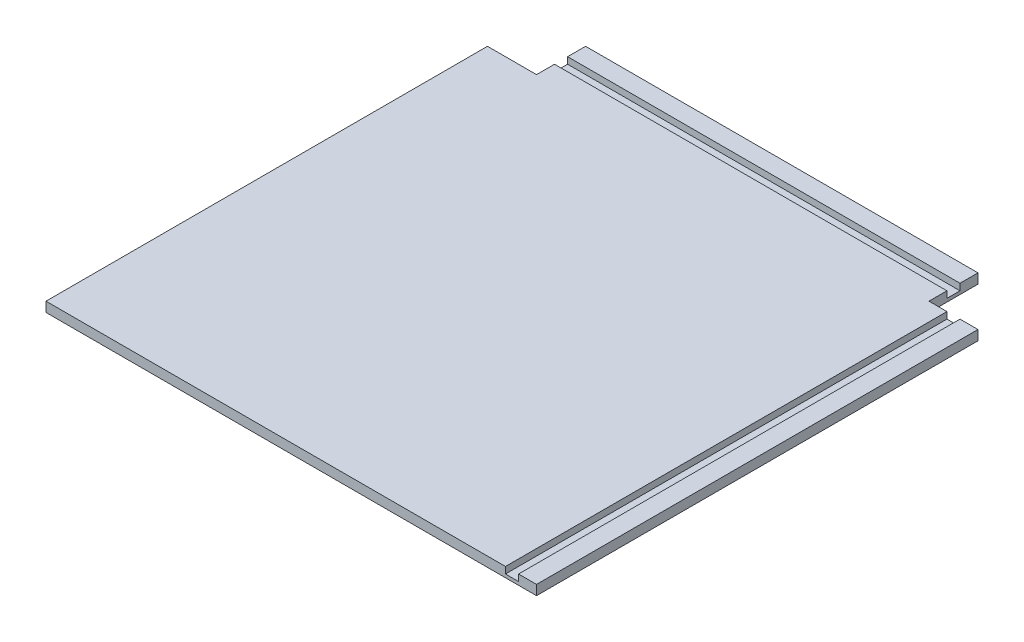
ISO-10303-21;
HEADER;
FILE_DESCRIPTION(('STEP AP214'),'2;1');
FILE_NAME('part.step','',(''),(''),'','','');
FILE_SCHEMA(('AUTOMOTIVE_DESIGN { 1 0 10303 214 1 1 1 1 }'));
ENDSEC;
DATA;
#1=APPLICATION_CONTEXT('core data for automotive mechanical design processes');
#2=APPLICATION_PROTOCOL_DEFINITION('international standard','automotive_design',2000,#1);
#3=PRODUCT_CONTEXT('',#1,'mechanical');
#4=PRODUCT('Part','Part','',(#3));
#5=PRODUCT_RELATED_PRODUCT_CATEGORY('part','',(#4));
#6=PRODUCT_DEFINITION_FORMATION('','',#4);
#7=PRODUCT_DEFINITION_CONTEXT('part definition',#1,'design');
#8=PRODUCT_DEFINITION('design','',#6,#7);
#9=PRODUCT_DEFINITION_SHAPE('','',#8);
#10=(LENGTH_UNIT() NAMED_UNIT(*) SI_UNIT(.MILLI.,.METRE.));
#11=(NAMED_UNIT(*) PLANE_ANGLE_UNIT() SI_UNIT($,.RADIAN.));
#12=(NAMED_UNIT(*) SI_UNIT($,.STERADIAN.) SOLID_ANGLE_UNIT());
#13=UNCERTAINTY_MEASURE_WITH_UNIT(LENGTH_MEASURE(1.E-05),#10,'distance_accuracy_value','');
#14=(GEOMETRIC_REPRESENTATION_CONTEXT(3) GLOBAL_UNCERTAINTY_ASSIGNED_CONTEXT((#13)) GLOBAL_UNIT_ASSIGNED_CONTEXT((#10,
#11,#12)) REPRESENTATION_CONTEXT('',''));
#15=CARTESIAN_POINT('',(0.,0.,0.));
#16=DIRECTION('',(0.,0.,1.));
#17=DIRECTION('',(1.,0.,0.));
#18=AXIS2_PLACEMENT_3D('',#15,#16,#17);
#19=CARTESIAN_POINT('',(0.,15.,0.));
#20=DIRECTION('',(0.,1.,0.));
#21=DIRECTION('',(0.,0.,1.));
#22=AXIS2_PLACEMENT_3D('',#19,#20,#21);
#23=PLANE('',#22);
#24=DIRECTION('',(1.,0.,0.));
#25=VECTOR('',#24,1.);
#26=CARTESIAN_POINT('',(-375.,15.,-327.5));
#27=LINE('',#26,#25);
#28=CARTESIAN_POINT('',(-300.,15.,-327.5));
#29=VERTEX_POINT('',#28);
#30=CARTESIAN_POINT('',(300.,15.,-327.5));
#31=VERTEX_POINT('',#30);
#32=EDGE_CURVE('E306',#29,#31,#27,.T.);
#33=ORIENTED_EDGE('',*,*,#32,.F.);
#34=DIRECTION('',(0.,0.,1.));
#35=VECTOR('',#34,1.);
#36=CARTESIAN_POINT('',(-300.,15.,0.));
#37=LINE('',#36,#35);
#38=CARTESIAN_POINT('',(-300.,15.,-300.));
#39=VERTEX_POINT('',#38);
#40=EDGE_CURVE('E172',#29,#39,#37,.T.);
#41=ORIENTED_EDGE('',*,*,#40,.T.);
#42=DIRECTION('',(1.,0.,0.));
#43=VECTOR('',#42,1.);
#44=CARTESIAN_POINT('',(0.,15.,-300.));
#45=LINE('',#44,#43);
#46=CARTESIAN_POINT('',(-375.,15.,-300.));
#47=VERTEX_POINT('',#46);
#48=EDGE_CURVE('E182',#47,#39,#45,.T.);
#49=ORIENTED_EDGE('',*,*,#48,.F.);
#50=DIRECTION('',(0.,0.,-1.));
#51=VECTOR('',#50,1.);
#52=CARTESIAN_POINT('',(-375.,15.,0.));
#53=LINE('',#52,#51);
#54=CARTESIAN_POINT('',(-375.,15.,375.));
#55=VERTEX_POINT('',#54);
#56=EDGE_CURVE('E189',#55,#47,#53,.T.);
#57=ORIENTED_EDGE('',*,*,#56,.F.);
#58=DIRECTION('',(1.,0.,0.));
#59=VECTOR('',#58,1.);
#60=CARTESIAN_POINT('',(0.,15.,375.));
#61=LINE('',#60,#59);
#62=CARTESIAN_POINT('',(327.5,15.,375.));
#63=VERTEX_POINT('',#62);
#64=EDGE_CURVE('E193',#55,#63,#61,.T.);
#65=ORIENTED_EDGE('',*,*,#64,.T.);
#66=DIRECTION('',(0.,0.,1.));
#67=VECTOR('',#66,1.);
#68=CARTESIAN_POINT('',(327.5,15.,-300.));
#69=LINE('',#68,#67);
#70=CARTESIAN_POINT('',(327.5,15.,-300.));
#71=VERTEX_POINT('',#70);
#72=EDGE_CURVE('E273',#71,#63,#69,.T.);
#73=ORIENTED_EDGE('',*,*,#72,.F.);
#74=DIRECTION('',(-1.,0.,0.));
#75=VECTOR('',#74,1.);
#76=CARTESIAN_POINT('',(0.,15.,-300.));
#77=LINE('',#76,#75);
#78=CARTESIAN_POINT('',(300.,15.,-300.));
#79=VERTEX_POINT('',#78);
#80=EDGE_CURVE('E198',#71,#79,#77,.T.);
#81=ORIENTED_EDGE('',*,*,#80,.T.);
#82=DIRECTION('',(0.,0.,1.));
#83=VECTOR('',#82,1.);
#84=CARTESIAN_POINT('',(300.,15.,0.));
#85=LINE('',#84,#83);
#86=EDGE_CURVE('E225',#31,#79,#85,.T.);
#87=ORIENTED_EDGE('',*,*,#86,.F.);
#88=EDGE_LOOP('',(#33,#41,#49,#57,#65,#73,#81,#87));
#89=FACE_BOUND('',#88,.T.);
#90=ADVANCED_FACE('F41',(#89),#23,.T.);
#91=CARTESIAN_POINT('',(0.,15.,375.));
#92=DIRECTION('',(0.,0.,-1.));
#93=DIRECTION('',(-1.,0.,0.));
#94=AXIS2_PLACEMENT_3D('',#91,#92,#93);
#95=PLANE('',#94);
#96=DIRECTION('',(0.,-1.,0.));
#97=VECTOR('',#96,1.);
#98=CARTESIAN_POINT('',(347.5,0.,375.));
#99=LINE('',#98,#97);
#100=CARTESIAN_POINT('',(347.5,15.,375.));
#101=VERTEX_POINT('',#100);
#102=CARTESIAN_POINT('',(347.5,5.,375.));
#103=VERTEX_POINT('',#102);
#104=EDGE_CURVE('E297',#101,#103,#99,.T.);
#105=ORIENTED_EDGE('',*,*,#104,.T.);
#106=DIRECTION('',(-1.,0.,0.));
#107=VECTOR('',#106,1.);
#108=CARTESIAN_POINT('',(0.,5.00000000000003,375.));
#109=LINE('',#108,#107);
#110=CARTESIAN_POINT('',(327.5,5.,375.));
#111=VERTEX_POINT('',#110);
#112=EDGE_CURVE('E293',#103,#111,#109,.T.);
#113=ORIENTED_EDGE('',*,*,#112,.T.);
#114=DIRECTION('',(0.,1.,0.));
#115=VECTOR('',#114,1.);
#116=CARTESIAN_POINT('',(327.5,-1.81799020282369E-12,375.));
#117=LINE('',#116,#115);
#118=EDGE_CURVE('E271',#111,#63,#117,.T.);
#119=ORIENTED_EDGE('',*,*,#118,.T.);
#120=ORIENTED_EDGE('',*,*,#64,.F.);
#121=DIRECTION('',(0.,-1.,0.));
#122=VECTOR('',#121,1.);
#123=CARTESIAN_POINT('',(-375.,15.,375.));
#124=LINE('',#123,#122);
#125=CARTESIAN_POINT('',(-375.,0.,375.));
#126=VERTEX_POINT('',#125);
#127=EDGE_CURVE('E233',#55,#126,#124,.T.);
#128=ORIENTED_EDGE('',*,*,#127,.T.);
#129=DIRECTION('',(1.,0.,0.));
#130=VECTOR('',#129,1.);
#131=CARTESIAN_POINT('',(0.,0.,375.));
#132=LINE('',#131,#130);
#133=CARTESIAN_POINT('',(375.,0.,375.));
#134=VERTEX_POINT('',#133);
#135=EDGE_CURVE('E218',#126,#134,#132,.T.);
#136=ORIENTED_EDGE('',*,*,#135,.T.);
#137=DIRECTION('',(0.,-1.,0.));
#138=VECTOR('',#137,1.);
#139=CARTESIAN_POINT('',(375.,15.,375.));
#140=LINE('',#139,#138);
#141=CARTESIAN_POINT('',(375.,15.,375.));
#142=VERTEX_POINT('',#141);
#143=EDGE_CURVE('E230',#142,#134,#140,.T.);
#144=ORIENTED_EDGE('',*,*,#143,.F.);
#145=EDGE_CURVE('E192',#101,#142,#61,.T.);
#146=ORIENTED_EDGE('',*,*,#145,.F.);
#147=EDGE_LOOP('',(#105,#113,#119,#120,#128,#136,#144,#146));
#148=FACE_BOUND('',#147,.T.);
#149=ADVANCED_FACE('F268',(#148),#95,.F.);
#150=CARTESIAN_POINT('',(0.,15.,-300.));
#151=DIRECTION('',(0.,0.,1.));
#152=DIRECTION('',(1.,0.,0.));
#153=AXIS2_PLACEMENT_3D('',#150,#151,#152);
#154=PLANE('',#153);
#155=DIRECTION('',(0.,-1.,0.));
#156=VECTOR('',#155,1.);
#157=CARTESIAN_POINT('',(347.5,0.,-300.));
#158=LINE('',#157,#156);
#159=CARTESIAN_POINT('',(347.5,15.,-300.));
#160=VERTEX_POINT('',#159);
#161=CARTESIAN_POINT('',(347.5,5.,-300.));
#162=VERTEX_POINT('',#161);
#163=EDGE_CURVE('E295',#160,#162,#158,.T.);
#164=ORIENTED_EDGE('',*,*,#163,.F.);
#165=CARTESIAN_POINT('',(375.,15.,-300.));
#166=VERTEX_POINT('',#165);
#167=EDGE_CURVE('E199',#166,#160,#77,.T.);
#168=ORIENTED_EDGE('',*,*,#167,.F.);
#169=DIRECTION('',(0.,-1.,0.));
#170=VECTOR('',#169,1.);
#171=CARTESIAN_POINT('',(375.,15.,-300.));
#172=LINE('',#171,#170);
#173=CARTESIAN_POINT('',(375.,0.,-300.));
#174=VERTEX_POINT('',#173);
#175=EDGE_CURVE('E227',#166,#174,#172,.T.);
#176=ORIENTED_EDGE('',*,*,#175,.T.);
#177=DIRECTION('',(-1.,0.,0.));
#178=VECTOR('',#177,1.);
#179=CARTESIAN_POINT('',(0.,0.,-300.));
#180=LINE('',#179,#178);
#181=CARTESIAN_POINT('',(300.,0.,-300.));
#182=VERTEX_POINT('',#181);
#183=EDGE_CURVE('E222',#174,#182,#180,.T.);
#184=ORIENTED_EDGE('',*,*,#183,.T.);
#185=DIRECTION('',(0.,-1.,0.));
#186=VECTOR('',#185,1.);
#187=CARTESIAN_POINT('',(300.,15.,-300.));
#188=LINE('',#187,#186);
#189=EDGE_CURVE('E202',#79,#182,#188,.T.);
#190=ORIENTED_EDGE('',*,*,#189,.F.);
#191=ORIENTED_EDGE('',*,*,#80,.F.);
#192=DIRECTION('',(0.,1.,0.));
#193=VECTOR('',#192,1.);
#194=CARTESIAN_POINT('',(327.5,-1.81799020282369E-12,-300.));
#195=LINE('',#194,#193);
#196=CARTESIAN_POINT('',(327.5,5.,-300.));
#197=VERTEX_POINT('',#196);
#198=EDGE_CURVE('E64',#197,#71,#195,.T.);
#199=ORIENTED_EDGE('',*,*,#198,.F.);
#200=DIRECTION('',(-1.,0.,0.));
#201=VECTOR('',#200,1.);
#202=CARTESIAN_POINT('',(0.,5.00000000000003,-300.));
#203=LINE('',#202,#201);
#204=EDGE_CURVE('E288',#162,#197,#203,.T.);
#205=ORIENTED_EDGE('',*,*,#204,.F.);
#206=EDGE_LOOP('',(#164,#168,#176,#184,#190,#191,#199,#205));
#207=FACE_BOUND('',#206,.T.);
#208=ADVANCED_FACE('F282',(#207),#154,.F.);
#209=ORIENTED_EDGE('',*,*,#167,.T.);
#210=DIRECTION('',(0.,0.,1.));
#211=VECTOR('',#210,1.);
#212=CARTESIAN_POINT('',(347.5,15.,-300.));
#213=LINE('',#212,#211);
#214=EDGE_CURVE('E278',#160,#101,#213,.T.);
#215=ORIENTED_EDGE('',*,*,#214,.T.);
#216=ORIENTED_EDGE('',*,*,#145,.T.);
#217=DIRECTION('',(0.,0.,-1.));
#218=VECTOR('',#217,1.);
#219=CARTESIAN_POINT('',(375.,15.,0.));
#220=LINE('',#219,#218);
#221=EDGE_CURVE('E196',#142,#166,#220,.T.);
#222=ORIENTED_EDGE('',*,*,#221,.T.);
#223=EDGE_LOOP('',(#209,#215,#216,#222));
#224=FACE_BOUND('',#223,.T.);
#225=ADVANCED_FACE('F323',(#224),#23,.T.);
#226=DIRECTION('',(1.,0.,0.));
#227=VECTOR('',#226,1.);
#228=CARTESIAN_POINT('',(-375.,15.,-347.5));
#229=LINE('',#228,#227);
#230=CARTESIAN_POINT('',(-300.,15.,-347.5));
#231=VERTEX_POINT('',#230);
#232=CARTESIAN_POINT('',(300.,15.,-347.5));
#233=VERTEX_POINT('',#232);
#234=EDGE_CURVE('E247',#231,#233,#229,.T.);
#235=ORIENTED_EDGE('',*,*,#234,.T.);
#236=CARTESIAN_POINT('',(300.,15.,-375.));
#237=VERTEX_POINT('',#236);
#238=EDGE_CURVE('E184',#237,#233,#85,.T.);
#239=ORIENTED_EDGE('',*,*,#238,.F.);
#240=DIRECTION('',(1.,0.,0.));
#241=VECTOR('',#240,1.);
#242=CARTESIAN_POINT('',(0.,15.,-375.));
#243=LINE('',#242,#241);
#244=CARTESIAN_POINT('',(-300.,15.,-375.));
#245=VERTEX_POINT('',#244);
#246=EDGE_CURVE('E179',#245,#237,#243,.T.);
#247=ORIENTED_EDGE('',*,*,#246,.F.);
#248=EDGE_CURVE('E178',#245,#231,#37,.T.);
#249=ORIENTED_EDGE('',*,*,#248,.T.);
#250=EDGE_LOOP('',(#235,#239,#247,#249));
#251=FACE_BOUND('',#250,.T.);
#252=ADVANCED_FACE('F245',(#251),#23,.T.);
#253=CARTESIAN_POINT('',(300.,15.,0.));
#254=DIRECTION('',(1.,0.,0.));
#255=DIRECTION('',(0.,0.,-1.));
#256=AXIS2_PLACEMENT_3D('',#253,#254,#255);
#257=PLANE('',#256);
#258=DIRECTION('',(0.,-1.,0.));
#259=VECTOR('',#258,1.);
#260=CARTESIAN_POINT('',(300.,15.,-327.5));
#261=LINE('',#260,#259);
#262=CARTESIAN_POINT('',(300.,5.,-327.5));
#263=VERTEX_POINT('',#262);
#264=EDGE_CURVE('E167',#31,#263,#261,.T.);
#265=ORIENTED_EDGE('',*,*,#264,.F.);
#266=ORIENTED_EDGE('',*,*,#86,.T.);
#267=ORIENTED_EDGE('',*,*,#189,.T.);
#268=DIRECTION('',(0.,0.,1.));
#269=VECTOR('',#268,1.);
#270=CARTESIAN_POINT('',(300.,0.,0.));
#271=LINE('',#270,#269);
#272=CARTESIAN_POINT('',(300.,0.,-375.));
#273=VERTEX_POINT('',#272);
#274=EDGE_CURVE('E203',#273,#182,#271,.T.);
#275=ORIENTED_EDGE('',*,*,#274,.F.);
#276=DIRECTION('',(0.,-1.,0.));
#277=VECTOR('',#276,1.);
#278=CARTESIAN_POINT('',(300.,15.,-375.));
#279=LINE('',#278,#277);
#280=EDGE_CURVE('E161',#237,#273,#279,.T.);
#281=ORIENTED_EDGE('',*,*,#280,.F.);
#282=ORIENTED_EDGE('',*,*,#238,.T.);
#283=DIRECTION('',(0.,1.,0.));
#284=VECTOR('',#283,1.);
#285=CARTESIAN_POINT('',(300.,15.,-347.5));
#286=LINE('',#285,#284);
#287=CARTESIAN_POINT('',(300.,5.,-347.5));
#288=VERTEX_POINT('',#287);
#289=EDGE_CURVE('E303',#288,#233,#286,.T.);
#290=ORIENTED_EDGE('',*,*,#289,.F.);
#291=DIRECTION('',(0.,0.,-1.));
#292=VECTOR('',#291,1.);
#293=CARTESIAN_POINT('',(300.,5.,0.));
#294=LINE('',#293,#292);
#295=EDGE_CURVE('E305',#263,#288,#294,.T.);
#296=ORIENTED_EDGE('',*,*,#295,.F.);
#297=EDGE_LOOP('',(#265,#266,#267,#275,#281,#282,#290,#296));
#298=FACE_BOUND('',#297,.T.);
#299=ADVANCED_FACE('F43',(#298),#257,.T.);
#300=CARTESIAN_POINT('',(0.,15.,-375.));
#301=DIRECTION('',(0.,0.,-1.));
#302=DIRECTION('',(-1.,0.,0.));
#303=AXIS2_PLACEMENT_3D('',#300,#301,#302);
#304=PLANE('',#303);
#305=DIRECTION('',(1.,0.,0.));
#306=VECTOR('',#305,1.);
#307=CARTESIAN_POINT('',(0.,0.,-375.));
#308=LINE('',#307,#306);
#309=CARTESIAN_POINT('',(-300.,0.,-375.));
#310=VERTEX_POINT('',#309);
#311=EDGE_CURVE('E206',#310,#273,#308,.T.);
#312=ORIENTED_EDGE('',*,*,#311,.F.);
#313=DIRECTION('',(0.,-1.,0.));
#314=VECTOR('',#313,1.);
#315=CARTESIAN_POINT('',(-300.,15.,-375.));
#316=LINE('',#315,#314);
#317=EDGE_CURVE('E238',#245,#310,#316,.T.);
#318=ORIENTED_EDGE('',*,*,#317,.F.);
#319=ORIENTED_EDGE('',*,*,#246,.T.);
#320=ORIENTED_EDGE('',*,*,#280,.T.);
#321=EDGE_LOOP('',(#312,#318,#319,#320));
#322=FACE_BOUND('',#321,.T.);
#323=ADVANCED_FACE('F251',(#322),#304,.T.);
#324=CARTESIAN_POINT('',(-300.,15.,0.));
#325=DIRECTION('',(1.,0.,0.));
#326=DIRECTION('',(0.,0.,-1.));
#327=AXIS2_PLACEMENT_3D('',#324,#325,#326);
#328=PLANE('',#327);
#329=ORIENTED_EDGE('',*,*,#40,.F.);
#330=DIRECTION('',(0.,-1.,0.));
#331=VECTOR('',#330,1.);
#332=CARTESIAN_POINT('',(-300.,15.,-327.5));
#333=LINE('',#332,#331);
#334=CARTESIAN_POINT('',(-300.,5.,-327.5));
#335=VERTEX_POINT('',#334);
#336=EDGE_CURVE('E11',#29,#335,#333,.T.);
#337=ORIENTED_EDGE('',*,*,#336,.T.);
#338=DIRECTION('',(0.,0.,-1.));
#339=VECTOR('',#338,1.);
#340=CARTESIAN_POINT('',(-300.,5.,0.));
#341=LINE('',#340,#339);
#342=CARTESIAN_POINT('',(-300.,5.,-347.5));
#343=VERTEX_POINT('',#342);
#344=EDGE_CURVE('E154',#335,#343,#341,.T.);
#345=ORIENTED_EDGE('',*,*,#344,.T.);
#346=DIRECTION('',(0.,1.,0.));
#347=VECTOR('',#346,1.);
#348=CARTESIAN_POINT('',(-300.,15.,-347.5));
#349=LINE('',#348,#347);
#350=EDGE_CURVE('E49',#343,#231,#349,.T.);
#351=ORIENTED_EDGE('',*,*,#350,.T.);
#352=ORIENTED_EDGE('',*,*,#248,.F.);
#353=ORIENTED_EDGE('',*,*,#317,.T.);
#354=DIRECTION('',(0.,0.,1.));
#355=VECTOR('',#354,1.);
#356=CARTESIAN_POINT('',(-300.,0.,0.));
#357=LINE('',#356,#355);
#358=CARTESIAN_POINT('',(-300.,0.,-300.));
#359=VERTEX_POINT('',#358);
#360=EDGE_CURVE('E210',#310,#359,#357,.T.);
#361=ORIENTED_EDGE('',*,*,#360,.T.);
#362=DIRECTION('',(0.,-1.,0.));
#363=VECTOR('',#362,1.);
#364=CARTESIAN_POINT('',(-300.,15.,-300.));
#365=LINE('',#364,#363);
#366=EDGE_CURVE('E174',#39,#359,#365,.T.);
#367=ORIENTED_EDGE('',*,*,#366,.F.);
#368=EDGE_LOOP('',(#329,#337,#345,#351,#352,#353,#361,#367));
#369=FACE_BOUND('',#368,.T.);
#370=ADVANCED_FACE('F170',(#369),#328,.F.);
#371=CARTESIAN_POINT('',(0.,15.,-300.));
#372=DIRECTION('',(0.,0.,-1.));
#373=DIRECTION('',(-1.,0.,0.));
#374=AXIS2_PLACEMENT_3D('',#371,#372,#373);
#375=PLANE('',#374);
#376=DIRECTION('',(1.,0.,0.));
#377=VECTOR('',#376,1.);
#378=CARTESIAN_POINT('',(0.,0.,-300.));
#379=LINE('',#378,#377);
#380=CARTESIAN_POINT('',(-375.,0.,-300.));
#381=VERTEX_POINT('',#380);
#382=EDGE_CURVE('E212',#381,#359,#379,.T.);
#383=ORIENTED_EDGE('',*,*,#382,.F.);
#384=DIRECTION('',(0.,-1.,0.));
#385=VECTOR('',#384,1.);
#386=CARTESIAN_POINT('',(-375.,15.,-300.));
#387=LINE('',#386,#385);
#388=EDGE_CURVE('E235',#47,#381,#387,.T.);
#389=ORIENTED_EDGE('',*,*,#388,.F.);
#390=ORIENTED_EDGE('',*,*,#48,.T.);
#391=ORIENTED_EDGE('',*,*,#366,.T.);
#392=EDGE_LOOP('',(#383,#389,#390,#391));
#393=FACE_BOUND('',#392,.T.);
#394=ADVANCED_FACE('F260',(#393),#375,.T.);
#395=CARTESIAN_POINT('',(-375.,15.,0.));
#396=DIRECTION('',(-1.,0.,0.));
#397=DIRECTION('',(0.,0.,1.));
#398=AXIS2_PLACEMENT_3D('',#395,#396,#397);
#399=PLANE('',#398);
#400=DIRECTION('',(0.,0.,-1.));
#401=VECTOR('',#400,1.);
#402=CARTESIAN_POINT('',(-375.,0.,0.));
#403=LINE('',#402,#401);
#404=EDGE_CURVE('E215',#126,#381,#403,.T.);
#405=ORIENTED_EDGE('',*,*,#404,.F.);
#406=ORIENTED_EDGE('',*,*,#127,.F.);
#407=ORIENTED_EDGE('',*,*,#56,.T.);
#408=ORIENTED_EDGE('',*,*,#388,.T.);
#409=EDGE_LOOP('',(#405,#406,#407,#408));
#410=FACE_BOUND('',#409,.T.);
#411=ADVANCED_FACE('F263',(#410),#399,.T.);
#412=CARTESIAN_POINT('',(375.,15.,0.));
#413=DIRECTION('',(-1.,0.,0.));
#414=DIRECTION('',(0.,0.,1.));
#415=AXIS2_PLACEMENT_3D('',#412,#413,#414);
#416=PLANE('',#415);
#417=DIRECTION('',(0.,0.,-1.));
#418=VECTOR('',#417,1.);
#419=CARTESIAN_POINT('',(375.,0.,0.));
#420=LINE('',#419,#418);
#421=EDGE_CURVE('E220',#134,#174,#420,.T.);
#422=ORIENTED_EDGE('',*,*,#421,.T.);
#423=ORIENTED_EDGE('',*,*,#175,.F.);
#424=ORIENTED_EDGE('',*,*,#221,.F.);
#425=ORIENTED_EDGE('',*,*,#143,.T.);
#426=EDGE_LOOP('',(#422,#423,#424,#425));
#427=FACE_BOUND('',#426,.T.);
#428=ADVANCED_FACE('F349',(#427),#416,.F.);
#429=CARTESIAN_POINT('',(0.,0.,0.));
#430=DIRECTION('',(0.,1.,0.));
#431=DIRECTION('',(0.,0.,1.));
#432=AXIS2_PLACEMENT_3D('',#429,#430,#431);
#433=PLANE('',#432);
#434=ORIENTED_EDGE('',*,*,#274,.T.);
#435=ORIENTED_EDGE('',*,*,#183,.F.);
#436=ORIENTED_EDGE('',*,*,#421,.F.);
#437=ORIENTED_EDGE('',*,*,#135,.F.);
#438=ORIENTED_EDGE('',*,*,#404,.T.);
#439=ORIENTED_EDGE('',*,*,#382,.T.);
#440=ORIENTED_EDGE('',*,*,#360,.F.);
#441=ORIENTED_EDGE('',*,*,#311,.T.);
#442=EDGE_LOOP('',(#434,#435,#436,#437,#438,#439,#440,#441));
#443=FACE_BOUND('',#442,.T.);
#444=ADVANCED_FACE('F255',(#443),#433,.F.);
#445=CARTESIAN_POINT('',(347.5,0.,-300.));
#446=DIRECTION('',(-1.,0.,0.));
#447=DIRECTION('',(0.,0.,1.));
#448=AXIS2_PLACEMENT_3D('',#445,#446,#447);
#449=PLANE('',#448);
#450=ORIENTED_EDGE('',*,*,#104,.F.);
#451=ORIENTED_EDGE('',*,*,#214,.F.);
#452=ORIENTED_EDGE('',*,*,#163,.T.);
#453=DIRECTION('',(0.,0.,1.));
#454=VECTOR('',#453,1.);
#455=CARTESIAN_POINT('',(347.5,5.,-300.));
#456=LINE('',#455,#454);
#457=EDGE_CURVE('E207',#162,#103,#456,.T.);
#458=ORIENTED_EDGE('',*,*,#457,.T.);
#459=EDGE_LOOP('',(#450,#451,#452,#458));
#460=FACE_BOUND('',#459,.T.);
#461=ADVANCED_FACE('F343',(#460),#449,.T.);
#462=CARTESIAN_POINT('',(0.,5.00000000000003,-300.));
#463=DIRECTION('',(0.,1.,0.));
#464=DIRECTION('',(-1.,0.,0.));
#465=AXIS2_PLACEMENT_3D('',#462,#463,#464);
#466=PLANE('',#465);
#467=ORIENTED_EDGE('',*,*,#112,.F.);
#468=ORIENTED_EDGE('',*,*,#457,.F.);
#469=ORIENTED_EDGE('',*,*,#204,.T.);
#470=DIRECTION('',(0.,0.,1.));
#471=VECTOR('',#470,1.);
#472=CARTESIAN_POINT('',(327.5,5.,-300.));
#473=LINE('',#472,#471);
#474=EDGE_CURVE('E277',#197,#111,#473,.T.);
#475=ORIENTED_EDGE('',*,*,#474,.T.);
#476=EDGE_LOOP('',(#467,#468,#469,#475));
#477=FACE_BOUND('',#476,.T.);
#478=ADVANCED_FACE('F345',(#477),#466,.T.);
#479=CARTESIAN_POINT('',(327.5,-1.81799020282369E-12,-300.));
#480=DIRECTION('',(1.,0.,0.));
#481=DIRECTION('',(0.,1.,0.));
#482=AXIS2_PLACEMENT_3D('',#479,#480,#481);
#483=PLANE('',#482);
#484=ORIENTED_EDGE('',*,*,#118,.F.);
#485=ORIENTED_EDGE('',*,*,#474,.F.);
#486=ORIENTED_EDGE('',*,*,#198,.T.);
#487=ORIENTED_EDGE('',*,*,#72,.T.);
#488=EDGE_LOOP('',(#484,#485,#486,#487));
#489=FACE_BOUND('',#488,.T.);
#490=ADVANCED_FACE('F319',(#489),#483,.T.);
#491=CARTESIAN_POINT('',(-375.,15.,-327.5));
#492=DIRECTION('',(0.,0.,1.));
#493=DIRECTION('',(1.,0.,0.));
#494=AXIS2_PLACEMENT_3D('',#491,#492,#493);
#495=PLANE('',#494);
#496=ORIENTED_EDGE('',*,*,#264,.T.);
#497=DIRECTION('',(1.,0.,0.));
#498=VECTOR('',#497,1.);
#499=CARTESIAN_POINT('',(-375.,5.,-327.5));
#500=LINE('',#499,#498);
#501=EDGE_CURVE('E157',#335,#263,#500,.T.);
#502=ORIENTED_EDGE('',*,*,#501,.F.);
#503=ORIENTED_EDGE('',*,*,#336,.F.);
#504=ORIENTED_EDGE('',*,*,#32,.T.);
#505=EDGE_LOOP('',(#496,#502,#503,#504));
#506=FACE_BOUND('',#505,.T.);
#507=ADVANCED_FACE('F164',(#506),#495,.F.);
#508=CARTESIAN_POINT('',(-375.,15.,-347.5));
#509=DIRECTION('',(0.,0.,-1.));
#510=DIRECTION('',(-1.,0.,0.));
#511=AXIS2_PLACEMENT_3D('',#508,#509,#510);
#512=PLANE('',#511);
#513=ORIENTED_EDGE('',*,*,#289,.T.);
#514=ORIENTED_EDGE('',*,*,#234,.F.);
#515=ORIENTED_EDGE('',*,*,#350,.F.);
#516=DIRECTION('',(1.,0.,0.));
#517=VECTOR('',#516,1.);
#518=CARTESIAN_POINT('',(-375.,5.,-347.5));
#519=LINE('',#518,#517);
#520=EDGE_CURVE('E56',#343,#288,#519,.T.);
#521=ORIENTED_EDGE('',*,*,#520,.T.);
#522=EDGE_LOOP('',(#513,#514,#515,#521));
#523=FACE_BOUND('',#522,.T.);
#524=ADVANCED_FACE('F311',(#523),#512,.F.);
#525=CARTESIAN_POINT('',(-375.,5.,-327.5));
#526=DIRECTION('',(0.,-1.,0.));
#527=DIRECTION('',(0.,0.,-1.));
#528=AXIS2_PLACEMENT_3D('',#525,#526,#527);
#529=PLANE('',#528);
#530=ORIENTED_EDGE('',*,*,#295,.T.);
#531=ORIENTED_EDGE('',*,*,#520,.F.);
#532=ORIENTED_EDGE('',*,*,#344,.F.);
#533=ORIENTED_EDGE('',*,*,#501,.T.);
#534=EDGE_LOOP('',(#530,#531,#532,#533));
#535=FACE_BOUND('',#534,.T.);
#536=ADVANCED_FACE('F156',(#535),#529,.F.);
#537=CLOSED_SHELL('',(#90,#149,#208,#225,#252,#299,#323,#370,#394,#411,#428,#444,#461,#478,#490,
#507,#524,#536));
#538=MANIFOLD_SOLID_BREP('B2',#537);
#539=ADVANCED_BREP_SHAPE_REPRESENTATION('',(#18,#538),#14);
#540=SHAPE_DEFINITION_REPRESENTATION(#9,#539);
ENDSEC;
END-ISO-10303-21;
